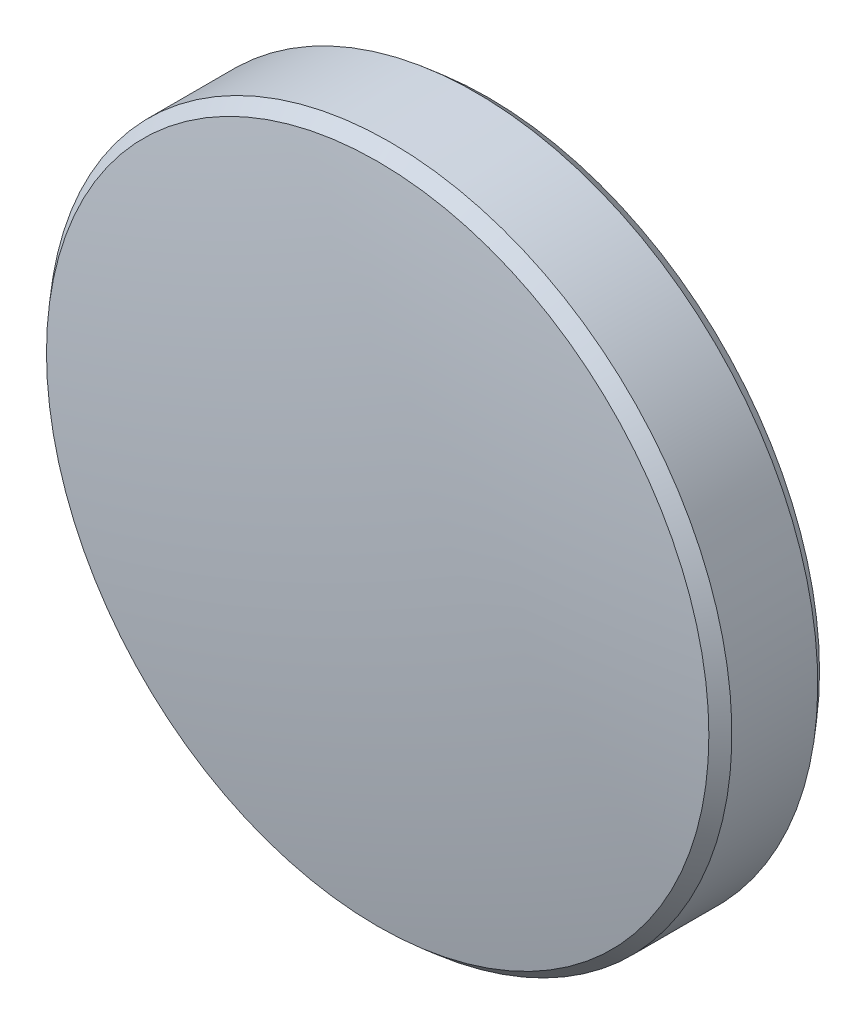
ISO-10303-21;
HEADER;
FILE_DESCRIPTION(('STEP AP214'),'2;1');
FILE_NAME('part.step','',(''),(''),'','','');
FILE_SCHEMA(('AUTOMOTIVE_DESIGN { 1 0 10303 214 1 1 1 1 }'));
ENDSEC;
DATA;
#1=APPLICATION_CONTEXT('core data for automotive mechanical design processes');
#2=APPLICATION_PROTOCOL_DEFINITION('international standard','automotive_design',2000,#1);
#3=PRODUCT_CONTEXT('',#1,'mechanical');
#4=PRODUCT('Part','Part','',(#3));
#5=PRODUCT_RELATED_PRODUCT_CATEGORY('part','',(#4));
#6=PRODUCT_DEFINITION_FORMATION('','',#4);
#7=PRODUCT_DEFINITION_CONTEXT('part definition',#1,'design');
#8=PRODUCT_DEFINITION('design','',#6,#7);
#9=PRODUCT_DEFINITION_SHAPE('','',#8);
#10=(LENGTH_UNIT() NAMED_UNIT(*) SI_UNIT(.MILLI.,.METRE.));
#11=(NAMED_UNIT(*) PLANE_ANGLE_UNIT() SI_UNIT($,.RADIAN.));
#12=(NAMED_UNIT(*) SI_UNIT($,.STERADIAN.) SOLID_ANGLE_UNIT());
#13=UNCERTAINTY_MEASURE_WITH_UNIT(LENGTH_MEASURE(1.E-05),#10,'distance_accuracy_value','');
#14=(GEOMETRIC_REPRESENTATION_CONTEXT(3) GLOBAL_UNCERTAINTY_ASSIGNED_CONTEXT((#13)) GLOBAL_UNIT_ASSIGNED_CONTEXT((#10,
#11,#12)) REPRESENTATION_CONTEXT('',''));
#15=CARTESIAN_POINT('',(0.,0.,0.));
#16=DIRECTION('',(0.,0.,1.));
#17=DIRECTION('',(1.,0.,0.));
#18=AXIS2_PLACEMENT_3D('',#15,#16,#17);
#19=CARTESIAN_POINT('',(0.,0.,-39.7));
#20=DIRECTION('',(0.,0.,1.));
#21=DIRECTION('',(0.,1.,0.));
#22=AXIS2_PLACEMENT_3D('',#19,#20,#21);
#23=SPHERICAL_SURFACE('',#22,41.1899999999999);
#24=CARTESIAN_POINT('',(0.,0.,1.02785587938615));
#25=DIRECTION('',(0.,0.,-1.));
#26=DIRECTION('',(0.,1.,0.));
#27=AXIS2_PLACEMENT_3D('',#24,#25,#26);
#28=CIRCLE('',#27,6.15287375686764);
#29=CARTESIAN_POINT('',(0.,6.15287375686763,1.02785587938615));
#30=VERTEX_POINT('',#29);
#31=EDGE_CURVE('E9',#30,#30,#28,.F.);
#32=ORIENTED_EDGE('',*,*,#31,.T.);
#33=EDGE_LOOP('',(#32));
#34=FACE_BOUND('',#33,.T.);
#35=ADVANCED_FACE('F13',(#34),#23,.T.);
#36=CARTESIAN_POINT('',(0.,0.,1.49));
#37=DIRECTION('',(0.,0.,1.));
#38=DIRECTION('',(0.,-1.,0.));
#39=AXIS2_PLACEMENT_3D('',#36,#37,#38);
#40=CYLINDRICAL_SURFACE('',#39,6.35);
#41=CARTESIAN_POINT('',(0.,0.,-0.797587152065897));
#42=DIRECTION('',(0.,0.,1.));
#43=DIRECTION('',(0.,-1.,0.));
#44=AXIS2_PLACEMENT_3D('',#41,#42,#43);
#45=CIRCLE('',#44,6.35);
#46=CARTESIAN_POINT('',(0.,-6.35,-0.797587152065898));
#47=VERTEX_POINT('',#46);
#48=EDGE_CURVE('E24',#47,#47,#45,.T.);
#49=ORIENTED_EDGE('',*,*,#48,.T.);
#50=EDGE_LOOP('',(#49));
#51=FACE_BOUND('',#50,.T.);
#52=CARTESIAN_POINT('',(0.,0.,0.797587152065869));
#53=DIRECTION('',(0.,0.,-1.));
#54=DIRECTION('',(0.,1.,0.));
#55=AXIS2_PLACEMENT_3D('',#52,#53,#54);
#56=CIRCLE('',#55,6.35);
#57=CARTESIAN_POINT('',(0.,6.35,0.79758715206587));
#58=VERTEX_POINT('',#57);
#59=EDGE_CURVE('E28',#58,#58,#56,.T.);
#60=ORIENTED_EDGE('',*,*,#59,.T.);
#61=EDGE_LOOP('',(#60));
#62=FACE_BOUND('',#61,.T.);
#63=ADVANCED_FACE('F34',(#51,#62),#40,.T.);
#64=CARTESIAN_POINT('',(0.,0.,39.7));
#65=DIRECTION('',(0.,0.,1.));
#66=DIRECTION('',(0.,-1.,0.));
#67=AXIS2_PLACEMENT_3D('',#64,#65,#66);
#68=SPHERICAL_SURFACE('',#67,41.1899999999999);
#69=CARTESIAN_POINT('',(0.,0.,-1.02785587938613));
#70=DIRECTION('',(0.,0.,1.));
#71=DIRECTION('',(0.,-1.,0.));
#72=AXIS2_PLACEMENT_3D('',#69,#70,#71);
#73=CIRCLE('',#72,6.15287375686767);
#74=CARTESIAN_POINT('',(0.,-6.15287375686766,-1.02785587938613));
#75=VERTEX_POINT('',#74);
#76=EDGE_CURVE('E20',#75,#75,#73,.F.);
#77=ORIENTED_EDGE('',*,*,#76,.T.);
#78=EDGE_LOOP('',(#77));
#79=FACE_BOUND('',#78,.T.);
#80=ADVANCED_FACE('F43',(#79),#68,.T.);
#81=CARTESIAN_POINT('',(0.,0.,-0.797587152065897));
#82=DIRECTION('',(0.,0.,1.));
#83=DIRECTION('',(0.,-1.,0.));
#84=AXIS2_PLACEMENT_3D('',#81,#82,#83);
#85=CONICAL_SURFACE('',#84,6.35,0.708007708494583);
#86=ORIENTED_EDGE('',*,*,#76,.F.);
#87=EDGE_LOOP('',(#86));
#88=FACE_BOUND('',#87,.T.);
#89=ORIENTED_EDGE('',*,*,#48,.F.);
#90=EDGE_LOOP('',(#89));
#91=FACE_BOUND('',#90,.T.);
#92=ADVANCED_FACE('F38',(#88,#91),#85,.T.);
#93=CARTESIAN_POINT('',(0.,0.,1.02785587938615));
#94=DIRECTION('',(0.,0.,-1.));
#95=DIRECTION('',(0.,1.,0.));
#96=AXIS2_PLACEMENT_3D('',#93,#94,#95);
#97=CONICAL_SURFACE('',#96,6.15287375686765,0.708007708494571);
#98=ORIENTED_EDGE('',*,*,#59,.F.);
#99=EDGE_LOOP('',(#98));
#100=FACE_BOUND('',#99,.T.);
#101=ORIENTED_EDGE('',*,*,#31,.F.);
#102=EDGE_LOOP('',(#101));
#103=FACE_BOUND('',#102,.T.);
#104=ADVANCED_FACE('F15',(#100,#103),#97,.T.);
#105=CLOSED_SHELL('',(#35,#63,#80,#92,#104));
#106=MANIFOLD_SOLID_BREP('B1',#105);
#107=ADVANCED_BREP_SHAPE_REPRESENTATION('',(#18,#106),#14);
#108=SHAPE_DEFINITION_REPRESENTATION(#9,#107);
ENDSEC;
END-ISO-10303-21;
